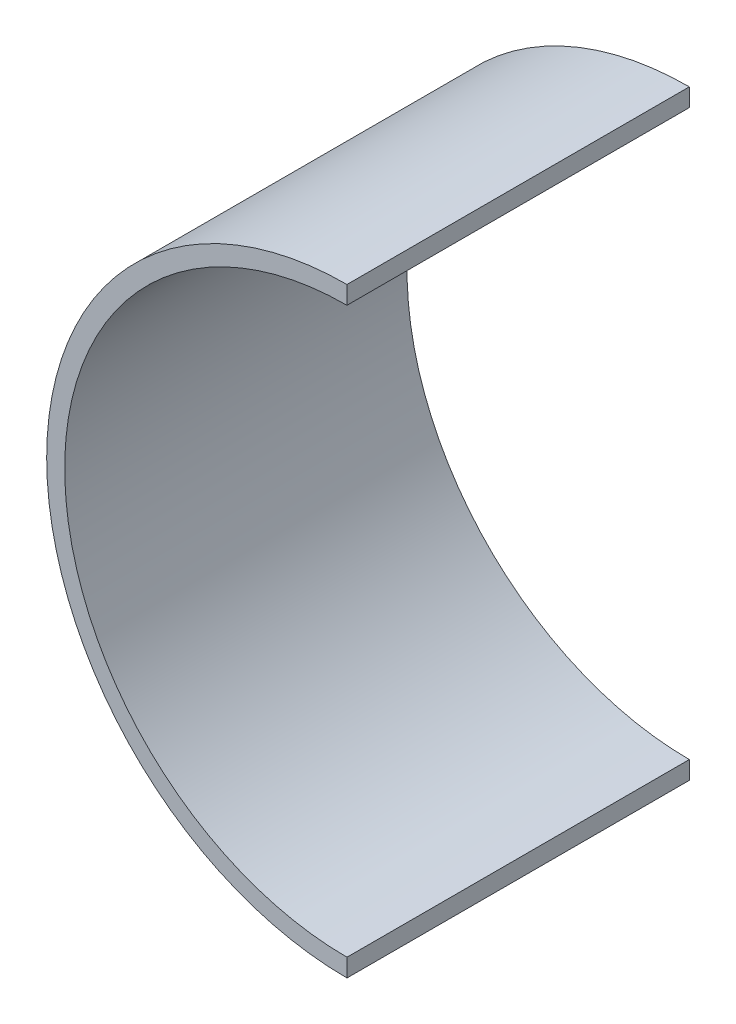
ISO-10303-21;
HEADER;
FILE_DESCRIPTION(('STEP AP214'),'2;1');
FILE_NAME('part.step','',(''),(''),'','','');
FILE_SCHEMA(('AUTOMOTIVE_DESIGN { 1 0 10303 214 1 1 1 1 }'));
ENDSEC;
DATA;
#1=APPLICATION_CONTEXT('core data for automotive mechanical design processes');
#2=APPLICATION_PROTOCOL_DEFINITION('international standard','automotive_design',2000,#1);
#3=PRODUCT_CONTEXT('',#1,'mechanical');
#4=PRODUCT('Part','Part','',(#3));
#5=PRODUCT_RELATED_PRODUCT_CATEGORY('part','',(#4));
#6=PRODUCT_DEFINITION_FORMATION('','',#4);
#7=PRODUCT_DEFINITION_CONTEXT('part definition',#1,'design');
#8=PRODUCT_DEFINITION('design','',#6,#7);
#9=PRODUCT_DEFINITION_SHAPE('','',#8);
#10=(LENGTH_UNIT() NAMED_UNIT(*) SI_UNIT(.MILLI.,.METRE.));
#11=(NAMED_UNIT(*) PLANE_ANGLE_UNIT() SI_UNIT($,.RADIAN.));
#12=(NAMED_UNIT(*) SI_UNIT($,.STERADIAN.) SOLID_ANGLE_UNIT());
#13=UNCERTAINTY_MEASURE_WITH_UNIT(LENGTH_MEASURE(1.E-05),#10,'distance_accuracy_value','');
#14=(GEOMETRIC_REPRESENTATION_CONTEXT(3) GLOBAL_UNCERTAINTY_ASSIGNED_CONTEXT((#13)) GLOBAL_UNIT_ASSIGNED_CONTEXT((#10,
#11,#12)) REPRESENTATION_CONTEXT('',''));
#15=CARTESIAN_POINT('',(0.,0.,0.));
#16=DIRECTION('',(0.,0.,1.));
#17=DIRECTION('',(1.,0.,0.));
#18=AXIS2_PLACEMENT_3D('',#15,#16,#17);
#19=CARTESIAN_POINT('',(0.,0.,3.));
#20=DIRECTION('',(0.,0.,1.));
#21=DIRECTION('',(1.,0.,0.));
#22=AXIS2_PLACEMENT_3D('',#19,#20,#21);
#23=PLANE('',#22);
#24=DIRECTION('',(0.,1.,0.));
#25=VECTOR('',#24,1.);
#26=CARTESIAN_POINT('',(-300.,0.,3.));
#27=LINE('',#26,#25);
#28=CARTESIAN_POINT('',(-300.,-50.,3.));
#29=VERTEX_POINT('',#28);
#30=CARTESIAN_POINT('',(-300.,-47.,3.));
#31=VERTEX_POINT('',#30);
#32=EDGE_CURVE('E40',#29,#31,#27,.T.);
#33=ORIENTED_EDGE('',*,*,#32,.F.);
#34=CARTESIAN_POINT('',(-300.,0.,3.));
#35=DIRECTION('',(0.,0.,1.));
#36=DIRECTION('',(1.,0.,0.));
#37=AXIS2_PLACEMENT_3D('',#34,#35,#36);
#38=CIRCLE('',#37,50.);
#39=CARTESIAN_POINT('',(-300.,50.,3.));
#40=VERTEX_POINT('',#39);
#41=EDGE_CURVE('E77',#40,#29,#38,.T.);
#42=ORIENTED_EDGE('',*,*,#41,.F.);
#43=DIRECTION('',(0.,1.,0.));
#44=VECTOR('',#43,1.);
#45=CARTESIAN_POINT('',(-300.,0.,3.));
#46=LINE('',#45,#44);
#47=CARTESIAN_POINT('',(-300.,47.,3.));
#48=VERTEX_POINT('',#47);
#49=EDGE_CURVE('E11',#48,#40,#46,.T.);
#50=ORIENTED_EDGE('',*,*,#49,.F.);
#51=CARTESIAN_POINT('',(-300.,0.,3.));
#52=DIRECTION('',(0.,0.,1.));
#53=DIRECTION('',(1.,0.,0.));
#54=AXIS2_PLACEMENT_3D('',#51,#52,#53);
#55=CIRCLE('',#54,47.);
#56=EDGE_CURVE('E35',#31,#48,#55,.F.);
#57=ORIENTED_EDGE('',*,*,#56,.F.);
#58=EDGE_LOOP('',(#33,#42,#50,#57));
#59=FACE_BOUND('',#58,.T.);
#60=ADVANCED_FACE('F32',(#59),#23,.F.);
#61=CARTESIAN_POINT('',(-300.,0.,60.));
#62=DIRECTION('',(0.,0.,1.));
#63=DIRECTION('',(1.,0.,0.));
#64=AXIS2_PLACEMENT_3D('',#61,#62,#63);
#65=PLANE('',#64);
#66=DIRECTION('',(0.,-1.,0.));
#67=VECTOR('',#66,1.);
#68=CARTESIAN_POINT('',(-300.,0.,60.));
#69=LINE('',#68,#67);
#70=CARTESIAN_POINT('',(-300.,50.,60.));
#71=VERTEX_POINT('',#70);
#72=CARTESIAN_POINT('',(-300.,47.,60.));
#73=VERTEX_POINT('',#72);
#74=EDGE_CURVE('E87',#71,#73,#69,.T.);
#75=ORIENTED_EDGE('',*,*,#74,.F.);
#76=CARTESIAN_POINT('',(-300.,0.,60.));
#77=DIRECTION('',(0.,0.,1.));
#78=DIRECTION('',(1.,0.,0.));
#79=AXIS2_PLACEMENT_3D('',#76,#77,#78);
#80=CIRCLE('',#79,50.);
#81=CARTESIAN_POINT('',(-300.,-50.,60.));
#82=VERTEX_POINT('',#81);
#83=EDGE_CURVE('E75',#71,#82,#80,.T.);
#84=ORIENTED_EDGE('',*,*,#83,.T.);
#85=CARTESIAN_POINT('',(-300.,-47.,60.));
#86=VERTEX_POINT('',#85);
#87=EDGE_CURVE('E79',#86,#82,#69,.T.);
#88=ORIENTED_EDGE('',*,*,#87,.F.);
#89=CARTESIAN_POINT('',(-300.,0.,60.));
#90=DIRECTION('',(0.,0.,1.));
#91=DIRECTION('',(1.,0.,0.));
#92=AXIS2_PLACEMENT_3D('',#89,#90,#91);
#93=CIRCLE('',#92,47.);
#94=EDGE_CURVE('E95',#73,#86,#93,.T.);
#95=ORIENTED_EDGE('',*,*,#94,.F.);
#96=EDGE_LOOP('',(#75,#84,#88,#95));
#97=FACE_BOUND('',#96,.T.);
#98=ADVANCED_FACE('F90',(#97),#65,.T.);
#99=CARTESIAN_POINT('',(-300.,0.,0.));
#100=DIRECTION('',(-1.,0.,0.));
#101=DIRECTION('',(0.,0.,1.));
#102=AXIS2_PLACEMENT_3D('',#99,#100,#101);
#103=PLANE('',#102);
#104=DIRECTION('',(0.,0.,-1.));
#105=VECTOR('',#104,1.);
#106=CARTESIAN_POINT('',(-300.,-50.,60.));
#107=LINE('',#106,#105);
#108=EDGE_CURVE('E70',#82,#29,#107,.T.);
#109=ORIENTED_EDGE('',*,*,#108,.T.);
#110=ORIENTED_EDGE('',*,*,#32,.T.);
#111=DIRECTION('',(0.,0.,1.));
#112=VECTOR('',#111,1.);
#113=CARTESIAN_POINT('',(-300.,-47.,3.));
#114=LINE('',#113,#112);
#115=EDGE_CURVE('E80',#31,#86,#114,.T.);
#116=ORIENTED_EDGE('',*,*,#115,.T.);
#117=ORIENTED_EDGE('',*,*,#87,.T.);
#118=EDGE_LOOP('',(#109,#110,#116,#117));
#119=FACE_BOUND('',#118,.T.);
#120=ADVANCED_FACE('F83',(#119),#103,.F.);
#121=DIRECTION('',(0.,0.,1.));
#122=VECTOR('',#121,1.);
#123=CARTESIAN_POINT('',(-300.,47.,3.));
#124=LINE('',#123,#122);
#125=EDGE_CURVE('E92',#48,#73,#124,.T.);
#126=ORIENTED_EDGE('',*,*,#125,.F.);
#127=ORIENTED_EDGE('',*,*,#49,.T.);
#128=DIRECTION('',(0.,0.,-1.));
#129=VECTOR('',#128,1.);
#130=CARTESIAN_POINT('',(-300.,50.,60.));
#131=LINE('',#130,#129);
#132=EDGE_CURVE('E93',#71,#40,#131,.T.);
#133=ORIENTED_EDGE('',*,*,#132,.F.);
#134=ORIENTED_EDGE('',*,*,#74,.T.);
#135=EDGE_LOOP('',(#126,#127,#133,#134));
#136=FACE_BOUND('',#135,.T.);
#137=ADVANCED_FACE('F105',(#136),#103,.F.);
#138=CARTESIAN_POINT('',(-300.,0.,60.));
#139=DIRECTION('',(0.,0.,-1.));
#140=DIRECTION('',(-1.,0.,0.));
#141=AXIS2_PLACEMENT_3D('',#138,#139,#140);
#142=CYLINDRICAL_SURFACE('',#141,50.);
#143=ORIENTED_EDGE('',*,*,#132,.T.);
#144=ORIENTED_EDGE('',*,*,#41,.T.);
#145=ORIENTED_EDGE('',*,*,#108,.F.);
#146=ORIENTED_EDGE('',*,*,#83,.F.);
#147=EDGE_LOOP('',(#143,#144,#145,#146));
#148=FACE_BOUND('',#147,.T.);
#149=ADVANCED_FACE('F73',(#148),#142,.T.);
#150=CARTESIAN_POINT('',(-300.,0.,3.));
#151=DIRECTION('',(0.,0.,1.));
#152=DIRECTION('',(1.,0.,0.));
#153=AXIS2_PLACEMENT_3D('',#150,#151,#152);
#154=CYLINDRICAL_SURFACE('',#153,47.);
#155=ORIENTED_EDGE('',*,*,#115,.F.);
#156=ORIENTED_EDGE('',*,*,#56,.T.);
#157=ORIENTED_EDGE('',*,*,#125,.T.);
#158=ORIENTED_EDGE('',*,*,#94,.T.);
#159=EDGE_LOOP('',(#155,#156,#157,#158));
#160=FACE_BOUND('',#159,.T.);
#161=ADVANCED_FACE('F102',(#160),#154,.F.);
#162=CLOSED_SHELL('',(#60,#98,#120,#137,#149,#161));
#163=MANIFOLD_SOLID_BREP('B2',#162);
#164=ADVANCED_BREP_SHAPE_REPRESENTATION('',(#18,#163),#14);
#165=SHAPE_DEFINITION_REPRESENTATION(#9,#164);
ENDSEC;
END-ISO-10303-21;
